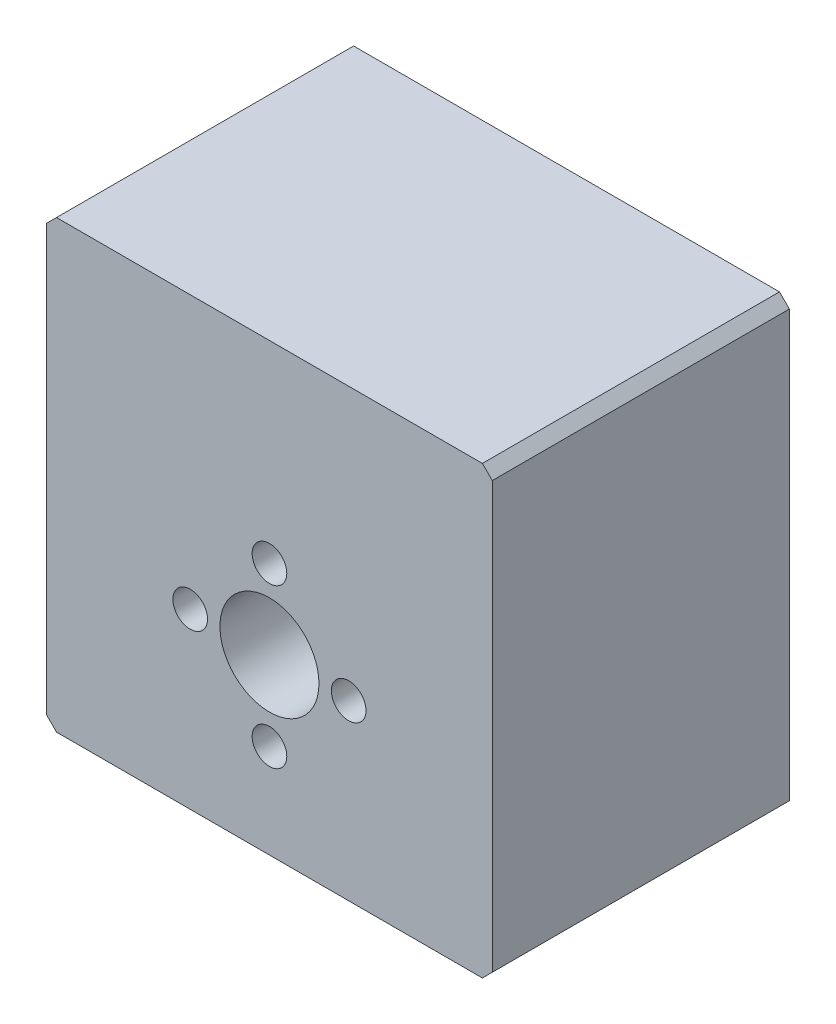
ISO-10303-21;
HEADER;
FILE_DESCRIPTION(('STEP AP214'),'2;1');
FILE_NAME('part.step','',(''),(''),'','','');
FILE_SCHEMA(('AUTOMOTIVE_DESIGN { 1 0 10303 214 1 1 1 1 }'));
ENDSEC;
DATA;
#1=APPLICATION_CONTEXT('core data for automotive mechanical design processes');
#2=APPLICATION_PROTOCOL_DEFINITION('international standard','automotive_design',2000,#1);
#3=PRODUCT_CONTEXT('',#1,'mechanical');
#4=PRODUCT('Part','Part','',(#3));
#5=PRODUCT_RELATED_PRODUCT_CATEGORY('part','',(#4));
#6=PRODUCT_DEFINITION_FORMATION('','',#4);
#7=PRODUCT_DEFINITION_CONTEXT('part definition',#1,'design');
#8=PRODUCT_DEFINITION('design','',#6,#7);
#9=PRODUCT_DEFINITION_SHAPE('','',#8);
#10=(LENGTH_UNIT() NAMED_UNIT(*) SI_UNIT(.MILLI.,.METRE.));
#11=(NAMED_UNIT(*) PLANE_ANGLE_UNIT() SI_UNIT($,.RADIAN.));
#12=(NAMED_UNIT(*) SI_UNIT($,.STERADIAN.) SOLID_ANGLE_UNIT());
#13=UNCERTAINTY_MEASURE_WITH_UNIT(LENGTH_MEASURE(1.E-05),#10,'distance_accuracy_value','');
#14=(GEOMETRIC_REPRESENTATION_CONTEXT(3) GLOBAL_UNCERTAINTY_ASSIGNED_CONTEXT((#13)) GLOBAL_UNIT_ASSIGNED_CONTEXT((#10,
#11,#12)) REPRESENTATION_CONTEXT('',''));
#15=CARTESIAN_POINT('',(0.,0.,0.));
#16=DIRECTION('',(0.,0.,1.));
#17=DIRECTION('',(1.,0.,0.));
#18=AXIS2_PLACEMENT_3D('',#15,#16,#17);
#19=CARTESIAN_POINT('',(0.,0.,15.));
#20=DIRECTION('',(0.,0.,-1.));
#21=DIRECTION('',(-1.,0.,0.));
#22=AXIS2_PLACEMENT_3D('',#19,#20,#21);
#23=PLANE('',#22);
#24=CARTESIAN_POINT('',(0.,8.00000000000001,15.));
#25=DIRECTION('',(0.,0.,1.));
#26=DIRECTION('',(1.,0.,0.));
#27=AXIS2_PLACEMENT_3D('',#24,#25,#26);
#28=CIRCLE('',#27,1.75000000000036);
#29=CARTESIAN_POINT('',(1.75000000000036,8.00000000000001,15.));
#30=VERTEX_POINT('',#29);
#31=EDGE_CURVE('E208',#30,#30,#28,.T.);
#32=ORIENTED_EDGE('',*,*,#31,.F.);
#33=EDGE_LOOP('',(#32));
#34=FACE_BOUND('',#33,.T.);
#35=CARTESIAN_POINT('',(0.,-8.00000000000001,15.));
#36=DIRECTION('',(0.,0.,1.));
#37=DIRECTION('',(1.,0.,0.));
#38=AXIS2_PLACEMENT_3D('',#35,#36,#37);
#39=CIRCLE('',#38,1.75000000000036);
#40=CARTESIAN_POINT('',(1.75000000000036,-8.00000000000001,15.));
#41=VERTEX_POINT('',#40);
#42=EDGE_CURVE('E202',#41,#41,#39,.T.);
#43=ORIENTED_EDGE('',*,*,#42,.F.);
#44=EDGE_LOOP('',(#43));
#45=FACE_BOUND('',#44,.T.);
#46=CARTESIAN_POINT('',(8.00000000000001,0.,15.));
#47=DIRECTION('',(0.,0.,1.));
#48=DIRECTION('',(1.,0.,0.));
#49=AXIS2_PLACEMENT_3D('',#46,#47,#48);
#50=CIRCLE('',#49,1.75000000000036);
#51=CARTESIAN_POINT('',(9.75000000000037,0.,15.));
#52=VERTEX_POINT('',#51);
#53=EDGE_CURVE('E196',#52,#52,#50,.T.);
#54=ORIENTED_EDGE('',*,*,#53,.F.);
#55=EDGE_LOOP('',(#54));
#56=FACE_BOUND('',#55,.T.);
#57=CARTESIAN_POINT('',(-8.00000000000001,0.,15.));
#58=DIRECTION('',(0.,0.,1.));
#59=DIRECTION('',(1.,0.,0.));
#60=AXIS2_PLACEMENT_3D('',#57,#58,#59);
#61=CIRCLE('',#60,1.75000000000036);
#62=CARTESIAN_POINT('',(-6.24999999999964,0.,15.));
#63=VERTEX_POINT('',#62);
#64=EDGE_CURVE('E189',#63,#63,#61,.T.);
#65=ORIENTED_EDGE('',*,*,#64,.F.);
#66=EDGE_LOOP('',(#65));
#67=FACE_BOUND('',#66,.T.);
#68=DIRECTION('',(0.,-1.,0.));
#69=VECTOR('',#68,1.);
#70=CARTESIAN_POINT('',(-22.5,-17.5000000000001,15.));
#71=LINE('',#70,#69);
#72=CARTESIAN_POINT('',(-22.5,26.4999999999999,15.));
#73=VERTEX_POINT('',#72);
#74=CARTESIAN_POINT('',(-22.5,-16.5000000000001,15.));
#75=VERTEX_POINT('',#74);
#76=EDGE_CURVE('E140',#73,#75,#71,.T.);
#77=ORIENTED_EDGE('',*,*,#76,.T.);
#78=DIRECTION('',(-0.707106781186548,0.707106781186548,0.));
#79=VECTOR('',#78,1.);
#80=CARTESIAN_POINT('',(-21.5,-17.5000000000001,15.));
#81=LINE('',#80,#79);
#82=CARTESIAN_POINT('',(-21.5,-17.5000000000001,15.));
#83=VERTEX_POINT('',#82);
#84=EDGE_CURVE('E154',#75,#83,#81,.F.);
#85=ORIENTED_EDGE('',*,*,#84,.T.);
#86=DIRECTION('',(1.,0.,0.));
#87=VECTOR('',#86,1.);
#88=CARTESIAN_POINT('',(22.5,-17.5000000000001,15.));
#89=LINE('',#88,#87);
#90=CARTESIAN_POINT('',(21.5,-17.5000000000001,15.));
#91=VERTEX_POINT('',#90);
#92=EDGE_CURVE('E121',#83,#91,#89,.T.);
#93=ORIENTED_EDGE('',*,*,#92,.T.);
#94=DIRECTION('',(-0.707106781186548,-0.707106781186548,0.));
#95=VECTOR('',#94,1.);
#96=CARTESIAN_POINT('',(22.5,-16.5000000000001,15.));
#97=LINE('',#96,#95);
#98=CARTESIAN_POINT('',(22.5,-16.5000000000001,15.));
#99=VERTEX_POINT('',#98);
#100=EDGE_CURVE('E150',#91,#99,#97,.F.);
#101=ORIENTED_EDGE('',*,*,#100,.T.);
#102=DIRECTION('',(0.,1.,0.));
#103=VECTOR('',#102,1.);
#104=CARTESIAN_POINT('',(22.5,27.4999999999999,15.));
#105=LINE('',#104,#103);
#106=CARTESIAN_POINT('',(22.5,26.4999999999999,15.));
#107=VERTEX_POINT('',#106);
#108=EDGE_CURVE('E163',#99,#107,#105,.T.);
#109=ORIENTED_EDGE('',*,*,#108,.T.);
#110=DIRECTION('',(0.707106781186548,-0.707106781186548,0.));
#111=VECTOR('',#110,1.);
#112=CARTESIAN_POINT('',(21.5,27.4999999999999,15.));
#113=LINE('',#112,#111);
#114=CARTESIAN_POINT('',(21.5,27.4999999999999,15.));
#115=VERTEX_POINT('',#114);
#116=EDGE_CURVE('E56',#107,#115,#113,.F.);
#117=ORIENTED_EDGE('',*,*,#116,.T.);
#118=DIRECTION('',(-1.,0.,0.));
#119=VECTOR('',#118,1.);
#120=CARTESIAN_POINT('',(-22.5,27.4999999999999,15.));
#121=LINE('',#120,#119);
#122=CARTESIAN_POINT('',(-21.5,27.4999999999999,15.));
#123=VERTEX_POINT('',#122);
#124=EDGE_CURVE('E141',#115,#123,#121,.T.);
#125=ORIENTED_EDGE('',*,*,#124,.T.);
#126=DIRECTION('',(0.707106781186548,0.707106781186548,0.));
#127=VECTOR('',#126,1.);
#128=CARTESIAN_POINT('',(-22.5,26.4999999999999,15.));
#129=LINE('',#128,#127);
#130=EDGE_CURVE('E152',#123,#73,#129,.F.);
#131=ORIENTED_EDGE('',*,*,#130,.T.);
#132=EDGE_LOOP('',(#77,#85,#93,#101,#109,#117,#125,#131));
#133=FACE_BOUND('',#132,.T.);
#134=CARTESIAN_POINT('',(0.,0.,15.));
#135=DIRECTION('',(0.,0.,1.));
#136=DIRECTION('',(1.,0.,0.));
#137=AXIS2_PLACEMENT_3D('',#134,#135,#136);
#138=CIRCLE('',#137,4.99999999999989);
#139=CARTESIAN_POINT('',(4.99999999999989,0.,15.));
#140=VERTEX_POINT('',#139);
#141=EDGE_CURVE('E135',#140,#140,#138,.T.);
#142=ORIENTED_EDGE('',*,*,#141,.F.);
#143=EDGE_LOOP('',(#142));
#144=FACE_BOUND('',#143,.T.);
#145=ADVANCED_FACE('F34',(#34,#45,#56,#67,#133,#144),#23,.F.);
#146=CARTESIAN_POINT('',(0.,0.,-15.));
#147=DIRECTION('',(0.,0.,-1.));
#148=DIRECTION('',(-1.,0.,0.));
#149=AXIS2_PLACEMENT_3D('',#146,#147,#148);
#150=PLANE('',#149);
#151=DIRECTION('',(1.,0.,0.));
#152=VECTOR('',#151,1.);
#153=CARTESIAN_POINT('',(22.5,-17.5000000000001,-15.));
#154=LINE('',#153,#152);
#155=CARTESIAN_POINT('',(-21.5,-17.5000000000001,-15.));
#156=VERTEX_POINT('',#155);
#157=CARTESIAN_POINT('',(21.5,-17.5000000000001,-15.));
#158=VERTEX_POINT('',#157);
#159=EDGE_CURVE('E118',#156,#158,#154,.T.);
#160=ORIENTED_EDGE('',*,*,#159,.F.);
#161=DIRECTION('',(0.707106781186548,-0.707106781186548,0.));
#162=VECTOR('',#161,1.);
#163=CARTESIAN_POINT('',(-19.5,-19.5,-15.));
#164=LINE('',#163,#162);
#165=CARTESIAN_POINT('',(-22.5,-16.5000000000001,-15.));
#166=VERTEX_POINT('',#165);
#167=EDGE_CURVE('E101',#156,#166,#164,.F.);
#168=ORIENTED_EDGE('',*,*,#167,.T.);
#169=DIRECTION('',(0.,-1.,0.));
#170=VECTOR('',#169,1.);
#171=CARTESIAN_POINT('',(-22.5,-17.5000000000001,-15.));
#172=LINE('',#171,#170);
#173=CARTESIAN_POINT('',(-22.5,26.4999999999999,-15.));
#174=VERTEX_POINT('',#173);
#175=EDGE_CURVE('E130',#174,#166,#172,.T.);
#176=ORIENTED_EDGE('',*,*,#175,.F.);
#177=DIRECTION('',(-0.707106781186548,-0.707106781186548,0.));
#178=VECTOR('',#177,1.);
#179=CARTESIAN_POINT('',(-24.4999999999999,24.4999999999999,-15.));
#180=LINE('',#179,#178);
#181=CARTESIAN_POINT('',(-21.5,27.4999999999999,-15.));
#182=VERTEX_POINT('',#181);
#183=EDGE_CURVE('E112',#174,#182,#180,.F.);
#184=ORIENTED_EDGE('',*,*,#183,.T.);
#185=DIRECTION('',(-1.,0.,0.));
#186=VECTOR('',#185,1.);
#187=CARTESIAN_POINT('',(-22.5,27.4999999999999,-15.));
#188=LINE('',#187,#186);
#189=CARTESIAN_POINT('',(21.5,27.4999999999999,-15.));
#190=VERTEX_POINT('',#189);
#191=EDGE_CURVE('E133',#190,#182,#188,.T.);
#192=ORIENTED_EDGE('',*,*,#191,.F.);
#193=DIRECTION('',(-0.707106781186548,0.707106781186548,0.));
#194=VECTOR('',#193,1.);
#195=CARTESIAN_POINT('',(24.4999999999999,24.4999999999999,-15.));
#196=LINE('',#195,#194);
#197=CARTESIAN_POINT('',(22.5,26.4999999999999,-15.));
#198=VERTEX_POINT('',#197);
#199=EDGE_CURVE('E122',#190,#198,#196,.F.);
#200=ORIENTED_EDGE('',*,*,#199,.T.);
#201=DIRECTION('',(0.,1.,0.));
#202=VECTOR('',#201,1.);
#203=CARTESIAN_POINT('',(22.5,27.4999999999999,-15.));
#204=LINE('',#203,#202);
#205=CARTESIAN_POINT('',(22.5,-16.5000000000001,-15.));
#206=VERTEX_POINT('',#205);
#207=EDGE_CURVE('E129',#206,#198,#204,.T.);
#208=ORIENTED_EDGE('',*,*,#207,.F.);
#209=DIRECTION('',(0.707106781186548,0.707106781186548,0.));
#210=VECTOR('',#209,1.);
#211=CARTESIAN_POINT('',(19.5,-19.5,-15.));
#212=LINE('',#211,#210);
#213=EDGE_CURVE('E128',#206,#158,#212,.F.);
#214=ORIENTED_EDGE('',*,*,#213,.T.);
#215=EDGE_LOOP('',(#160,#168,#176,#184,#192,#200,#208,#214));
#216=FACE_BOUND('',#215,.T.);
#217=CARTESIAN_POINT('',(0.,0.,-15.));
#218=DIRECTION('',(0.,0.,1.));
#219=DIRECTION('',(1.,0.,0.));
#220=AXIS2_PLACEMENT_3D('',#217,#218,#219);
#221=CIRCLE('',#220,4.99999999999989);
#222=CARTESIAN_POINT('',(4.99999999999989,0.,-15.));
#223=VERTEX_POINT('',#222);
#224=EDGE_CURVE('E183',#223,#223,#221,.T.);
#225=ORIENTED_EDGE('',*,*,#224,.T.);
#226=EDGE_LOOP('',(#225));
#227=FACE_BOUND('',#226,.T.);
#228=ADVANCED_FACE('F125',(#216,#227),#150,.T.);
#229=CARTESIAN_POINT('',(-22.5,-17.5000000000001,15.));
#230=DIRECTION('',(1.,0.,0.));
#231=DIRECTION('',(0.,0.,-1.));
#232=AXIS2_PLACEMENT_3D('',#229,#230,#231);
#233=PLANE('',#232);
#234=ORIENTED_EDGE('',*,*,#175,.T.);
#235=DIRECTION('',(0.,0.,1.));
#236=VECTOR('',#235,1.);
#237=CARTESIAN_POINT('',(-22.5,-16.5000000000001,15.));
#238=LINE('',#237,#236);
#239=EDGE_CURVE('E106',#166,#75,#238,.T.);
#240=ORIENTED_EDGE('',*,*,#239,.T.);
#241=ORIENTED_EDGE('',*,*,#76,.F.);
#242=DIRECTION('',(0.,0.,-1.));
#243=VECTOR('',#242,1.);
#244=CARTESIAN_POINT('',(-22.5,26.4999999999999,15.));
#245=LINE('',#244,#243);
#246=EDGE_CURVE('E111',#73,#174,#245,.T.);
#247=ORIENTED_EDGE('',*,*,#246,.T.);
#248=EDGE_LOOP('',(#234,#240,#241,#247));
#249=FACE_BOUND('',#248,.T.);
#250=ADVANCED_FACE('F179',(#249),#233,.F.);
#251=CARTESIAN_POINT('',(22.5,-17.5000000000001,15.));
#252=DIRECTION('',(0.,1.,0.));
#253=DIRECTION('',(0.,0.,1.));
#254=AXIS2_PLACEMENT_3D('',#251,#252,#253);
#255=PLANE('',#254);
#256=CARTESIAN_POINT('',(-15.,-17.5000000000001,8.));
#257=DIRECTION('',(0.,1.,0.));
#258=DIRECTION('',(0.,0.,-1.));
#259=AXIS2_PLACEMENT_3D('',#256,#257,#258);
#260=CIRCLE('',#259,2.);
#261=CARTESIAN_POINT('',(-15.,-17.5000000000001,6.));
#262=VERTEX_POINT('',#261);
#263=EDGE_CURVE('E231',#262,#262,#260,.T.);
#264=ORIENTED_EDGE('',*,*,#263,.T.);
#265=EDGE_LOOP('',(#264));
#266=FACE_BOUND('',#265,.T.);
#267=CARTESIAN_POINT('',(-15.,-17.5000000000001,-8.));
#268=DIRECTION('',(0.,1.,0.));
#269=DIRECTION('',(0.,0.,-1.));
#270=AXIS2_PLACEMENT_3D('',#267,#268,#269);
#271=CIRCLE('',#270,2.);
#272=CARTESIAN_POINT('',(-15.,-17.5000000000001,-10.));
#273=VERTEX_POINT('',#272);
#274=EDGE_CURVE('E225',#273,#273,#271,.T.);
#275=ORIENTED_EDGE('',*,*,#274,.T.);
#276=EDGE_LOOP('',(#275));
#277=FACE_BOUND('',#276,.T.);
#278=CARTESIAN_POINT('',(15.,-17.5000000000001,8.));
#279=DIRECTION('',(0.,-1.,0.));
#280=DIRECTION('',(0.,0.,-1.));
#281=AXIS2_PLACEMENT_3D('',#278,#279,#280);
#282=CIRCLE('',#281,2.);
#283=CARTESIAN_POINT('',(15.,-17.5000000000001,6.));
#284=VERTEX_POINT('',#283);
#285=EDGE_CURVE('E220',#284,#284,#282,.T.);
#286=ORIENTED_EDGE('',*,*,#285,.F.);
#287=EDGE_LOOP('',(#286));
#288=FACE_BOUND('',#287,.T.);
#289=CARTESIAN_POINT('',(15.,-17.5000000000001,-8.));
#290=DIRECTION('',(0.,-1.,0.));
#291=DIRECTION('',(0.,0.,-1.));
#292=AXIS2_PLACEMENT_3D('',#289,#290,#291);
#293=CIRCLE('',#292,2.);
#294=CARTESIAN_POINT('',(15.,-17.5000000000001,-10.));
#295=VERTEX_POINT('',#294);
#296=EDGE_CURVE('E213',#295,#295,#293,.T.);
#297=ORIENTED_EDGE('',*,*,#296,.F.);
#298=EDGE_LOOP('',(#297));
#299=FACE_BOUND('',#298,.T.);
#300=ORIENTED_EDGE('',*,*,#92,.F.);
#301=DIRECTION('',(0.,0.,-1.));
#302=VECTOR('',#301,1.);
#303=CARTESIAN_POINT('',(-21.5,-17.5000000000001,15.));
#304=LINE('',#303,#302);
#305=EDGE_CURVE('E105',#83,#156,#304,.T.);
#306=ORIENTED_EDGE('',*,*,#305,.T.);
#307=ORIENTED_EDGE('',*,*,#159,.T.);
#308=DIRECTION('',(0.,0.,1.));
#309=VECTOR('',#308,1.);
#310=CARTESIAN_POINT('',(21.5,-17.5000000000001,15.));
#311=LINE('',#310,#309);
#312=EDGE_CURVE('E123',#158,#91,#311,.T.);
#313=ORIENTED_EDGE('',*,*,#312,.T.);
#314=EDGE_LOOP('',(#300,#306,#307,#313));
#315=FACE_BOUND('',#314,.T.);
#316=ADVANCED_FACE('F117',(#266,#277,#288,#299,#315),#255,.F.);
#317=CARTESIAN_POINT('',(22.5,27.4999999999999,15.));
#318=DIRECTION('',(-1.,0.,0.));
#319=DIRECTION('',(0.,0.,1.));
#320=AXIS2_PLACEMENT_3D('',#317,#318,#319);
#321=PLANE('',#320);
#322=ORIENTED_EDGE('',*,*,#108,.F.);
#323=DIRECTION('',(0.,0.,-1.));
#324=VECTOR('',#323,1.);
#325=CARTESIAN_POINT('',(22.5,-16.5000000000001,15.));
#326=LINE('',#325,#324);
#327=EDGE_CURVE('E11',#99,#206,#326,.T.);
#328=ORIENTED_EDGE('',*,*,#327,.T.);
#329=ORIENTED_EDGE('',*,*,#207,.T.);
#330=DIRECTION('',(0.,0.,1.));
#331=VECTOR('',#330,1.);
#332=CARTESIAN_POINT('',(22.5,26.4999999999999,15.));
#333=LINE('',#332,#331);
#334=EDGE_CURVE('E42',#198,#107,#333,.T.);
#335=ORIENTED_EDGE('',*,*,#334,.T.);
#336=EDGE_LOOP('',(#322,#328,#329,#335));
#337=FACE_BOUND('',#336,.T.);
#338=ADVANCED_FACE('F162',(#337),#321,.F.);
#339=CARTESIAN_POINT('',(-22.5,27.4999999999999,15.));
#340=DIRECTION('',(0.,-1.,0.));
#341=DIRECTION('',(0.,0.,-1.));
#342=AXIS2_PLACEMENT_3D('',#339,#340,#341);
#343=PLANE('',#342);
#344=ORIENTED_EDGE('',*,*,#191,.T.);
#345=DIRECTION('',(0.,0.,1.));
#346=VECTOR('',#345,1.);
#347=CARTESIAN_POINT('',(-21.5,27.4999999999999,15.));
#348=LINE('',#347,#346);
#349=EDGE_CURVE('E49',#182,#123,#348,.T.);
#350=ORIENTED_EDGE('',*,*,#349,.T.);
#351=ORIENTED_EDGE('',*,*,#124,.F.);
#352=DIRECTION('',(0.,0.,-1.));
#353=VECTOR('',#352,1.);
#354=CARTESIAN_POINT('',(21.5,27.4999999999999,15.));
#355=LINE('',#354,#353);
#356=EDGE_CURVE('E156',#115,#190,#355,.T.);
#357=ORIENTED_EDGE('',*,*,#356,.T.);
#358=EDGE_LOOP('',(#344,#350,#351,#357));
#359=FACE_BOUND('',#358,.T.);
#360=ADVANCED_FACE('F172',(#359),#343,.F.);
#361=CARTESIAN_POINT('',(0.,0.,15.));
#362=DIRECTION('',(0.,0.,-1.));
#363=DIRECTION('',(-1.,0.,0.));
#364=AXIS2_PLACEMENT_3D('',#361,#362,#363);
#365=CYLINDRICAL_SURFACE('',#364,4.99999999999989);
#366=ORIENTED_EDGE('',*,*,#141,.T.);
#367=EDGE_LOOP('',(#366));
#368=FACE_BOUND('',#367,.T.);
#369=ORIENTED_EDGE('',*,*,#224,.F.);
#370=EDGE_LOOP('',(#369));
#371=FACE_BOUND('',#370,.T.);
#372=ADVANCED_FACE('F258',(#368,#371),#365,.F.);
#373=CARTESIAN_POINT('',(-8.00000000000001,0.,5.));
#374=DIRECTION('',(0.,0.,1.));
#375=DIRECTION('',(1.,0.,0.));
#376=AXIS2_PLACEMENT_3D('',#373,#374,#375);
#377=CYLINDRICAL_SURFACE('',#376,1.75000000000036);
#378=CARTESIAN_POINT('',(-8.00000000000001,0.,5.));
#379=DIRECTION('',(0.,0.,1.));
#380=DIRECTION('',(1.,0.,0.));
#381=AXIS2_PLACEMENT_3D('',#378,#379,#380);
#382=CIRCLE('',#381,1.75000000000036);
#383=CARTESIAN_POINT('',(-6.24999999999964,0.,5.));
#384=VERTEX_POINT('',#383);
#385=EDGE_CURVE('E192',#384,#384,#382,.T.);
#386=ORIENTED_EDGE('',*,*,#385,.F.);
#387=EDGE_LOOP('',(#386));
#388=FACE_BOUND('',#387,.T.);
#389=ORIENTED_EDGE('',*,*,#64,.T.);
#390=EDGE_LOOP('',(#389));
#391=FACE_BOUND('',#390,.T.);
#392=ADVANCED_FACE('F322',(#388,#391),#377,.F.);
#393=CARTESIAN_POINT('',(-8.00000000000001,0.,5.));
#394=DIRECTION('',(0.,0.,1.));
#395=DIRECTION('',(1.,0.,0.));
#396=AXIS2_PLACEMENT_3D('',#393,#394,#395);
#397=PLANE('',#396);
#398=ORIENTED_EDGE('',*,*,#385,.T.);
#399=EDGE_LOOP('',(#398));
#400=FACE_BOUND('',#399,.T.);
#401=ADVANCED_FACE('F319',(#400),#397,.T.);
#402=CARTESIAN_POINT('',(8.00000000000001,0.,5.));
#403=DIRECTION('',(0.,0.,1.));
#404=DIRECTION('',(1.,0.,0.));
#405=AXIS2_PLACEMENT_3D('',#402,#403,#404);
#406=CYLINDRICAL_SURFACE('',#405,1.75000000000036);
#407=CARTESIAN_POINT('',(8.00000000000001,0.,5.));
#408=DIRECTION('',(0.,0.,1.));
#409=DIRECTION('',(1.,0.,0.));
#410=AXIS2_PLACEMENT_3D('',#407,#408,#409);
#411=CIRCLE('',#410,1.75000000000036);
#412=CARTESIAN_POINT('',(9.75000000000037,0.,5.));
#413=VERTEX_POINT('',#412);
#414=EDGE_CURVE('E199',#413,#413,#411,.T.);
#415=ORIENTED_EDGE('',*,*,#414,.F.);
#416=EDGE_LOOP('',(#415));
#417=FACE_BOUND('',#416,.T.);
#418=ORIENTED_EDGE('',*,*,#53,.T.);
#419=EDGE_LOOP('',(#418));
#420=FACE_BOUND('',#419,.T.);
#421=ADVANCED_FACE('F315',(#417,#420),#406,.F.);
#422=CARTESIAN_POINT('',(8.00000000000001,0.,5.));
#423=DIRECTION('',(0.,0.,1.));
#424=DIRECTION('',(1.,0.,0.));
#425=AXIS2_PLACEMENT_3D('',#422,#423,#424);
#426=PLANE('',#425);
#427=ORIENTED_EDGE('',*,*,#414,.T.);
#428=EDGE_LOOP('',(#427));
#429=FACE_BOUND('',#428,.T.);
#430=ADVANCED_FACE('F311',(#429),#426,.T.);
#431=CARTESIAN_POINT('',(0.,-8.00000000000001,5.));
#432=DIRECTION('',(0.,0.,1.));
#433=DIRECTION('',(1.,0.,0.));
#434=AXIS2_PLACEMENT_3D('',#431,#432,#433);
#435=CYLINDRICAL_SURFACE('',#434,1.75000000000036);
#436=CARTESIAN_POINT('',(0.,-8.00000000000001,5.));
#437=DIRECTION('',(0.,0.,1.));
#438=DIRECTION('',(1.,0.,0.));
#439=AXIS2_PLACEMENT_3D('',#436,#437,#438);
#440=CIRCLE('',#439,1.75000000000036);
#441=CARTESIAN_POINT('',(1.75000000000036,-8.00000000000001,5.));
#442=VERTEX_POINT('',#441);
#443=EDGE_CURVE('E205',#442,#442,#440,.T.);
#444=ORIENTED_EDGE('',*,*,#443,.F.);
#445=EDGE_LOOP('',(#444));
#446=FACE_BOUND('',#445,.T.);
#447=ORIENTED_EDGE('',*,*,#42,.T.);
#448=EDGE_LOOP('',(#447));
#449=FACE_BOUND('',#448,.T.);
#450=ADVANCED_FACE('F307',(#446,#449),#435,.F.);
#451=CARTESIAN_POINT('',(0.,-8.00000000000001,5.));
#452=DIRECTION('',(0.,0.,1.));
#453=DIRECTION('',(1.,0.,0.));
#454=AXIS2_PLACEMENT_3D('',#451,#452,#453);
#455=PLANE('',#454);
#456=ORIENTED_EDGE('',*,*,#443,.T.);
#457=EDGE_LOOP('',(#456));
#458=FACE_BOUND('',#457,.T.);
#459=ADVANCED_FACE('F303',(#458),#455,.T.);
#460=CARTESIAN_POINT('',(0.,8.00000000000001,5.));
#461=DIRECTION('',(0.,0.,1.));
#462=DIRECTION('',(1.,0.,0.));
#463=AXIS2_PLACEMENT_3D('',#460,#461,#462);
#464=CYLINDRICAL_SURFACE('',#463,1.75000000000036);
#465=CARTESIAN_POINT('',(0.,8.00000000000001,5.));
#466=DIRECTION('',(0.,0.,1.));
#467=DIRECTION('',(1.,0.,0.));
#468=AXIS2_PLACEMENT_3D('',#465,#466,#467);
#469=CIRCLE('',#468,1.75000000000036);
#470=CARTESIAN_POINT('',(1.75000000000036,8.00000000000001,5.));
#471=VERTEX_POINT('',#470);
#472=EDGE_CURVE('E186',#471,#471,#469,.T.);
#473=ORIENTED_EDGE('',*,*,#472,.F.);
#474=EDGE_LOOP('',(#473));
#475=FACE_BOUND('',#474,.T.);
#476=ORIENTED_EDGE('',*,*,#31,.T.);
#477=EDGE_LOOP('',(#476));
#478=FACE_BOUND('',#477,.T.);
#479=ADVANCED_FACE('F299',(#475,#478),#464,.F.);
#480=CARTESIAN_POINT('',(0.,8.00000000000001,5.));
#481=DIRECTION('',(0.,0.,1.));
#482=DIRECTION('',(1.,0.,0.));
#483=AXIS2_PLACEMENT_3D('',#480,#481,#482);
#484=PLANE('',#483);
#485=ORIENTED_EDGE('',*,*,#472,.T.);
#486=EDGE_LOOP('',(#485));
#487=FACE_BOUND('',#486,.T.);
#488=ADVANCED_FACE('F272',(#487),#484,.T.);
#489=CARTESIAN_POINT('',(-21.5,-17.5000000000001,15.));
#490=DIRECTION('',(0.707106781186547,0.707106781186547,0.));
#491=DIRECTION('',(0.,0.,-1.));
#492=AXIS2_PLACEMENT_3D('',#489,#490,#491);
#493=PLANE('',#492);
#494=ORIENTED_EDGE('',*,*,#84,.F.);
#495=ORIENTED_EDGE('',*,*,#239,.F.);
#496=ORIENTED_EDGE('',*,*,#167,.F.);
#497=ORIENTED_EDGE('',*,*,#305,.F.);
#498=EDGE_LOOP('',(#494,#495,#496,#497));
#499=FACE_BOUND('',#498,.T.);
#500=ADVANCED_FACE('F104',(#499),#493,.F.);
#501=CARTESIAN_POINT('',(-22.5,26.4999999999999,15.));
#502=DIRECTION('',(0.707106781186547,-0.707106781186547,0.));
#503=DIRECTION('',(0.,0.,-1.));
#504=AXIS2_PLACEMENT_3D('',#501,#502,#503);
#505=PLANE('',#504);
#506=ORIENTED_EDGE('',*,*,#130,.F.);
#507=ORIENTED_EDGE('',*,*,#349,.F.);
#508=ORIENTED_EDGE('',*,*,#183,.F.);
#509=ORIENTED_EDGE('',*,*,#246,.F.);
#510=EDGE_LOOP('',(#506,#507,#508,#509));
#511=FACE_BOUND('',#510,.T.);
#512=ADVANCED_FACE('F176',(#511),#505,.F.);
#513=CARTESIAN_POINT('',(22.5,-16.5000000000001,15.));
#514=DIRECTION('',(-0.707106781186547,0.707106781186547,0.));
#515=DIRECTION('',(0.,0.,-1.));
#516=AXIS2_PLACEMENT_3D('',#513,#514,#515);
#517=PLANE('',#516);
#518=ORIENTED_EDGE('',*,*,#100,.F.);
#519=ORIENTED_EDGE('',*,*,#312,.F.);
#520=ORIENTED_EDGE('',*,*,#213,.F.);
#521=ORIENTED_EDGE('',*,*,#327,.F.);
#522=EDGE_LOOP('',(#518,#519,#520,#521));
#523=FACE_BOUND('',#522,.T.);
#524=ADVANCED_FACE('F274',(#523),#517,.F.);
#525=CARTESIAN_POINT('',(21.5,27.4999999999999,15.));
#526=DIRECTION('',(-0.707106781186547,-0.707106781186547,0.));
#527=DIRECTION('',(0.,0.,-1.));
#528=AXIS2_PLACEMENT_3D('',#525,#526,#527);
#529=PLANE('',#528);
#530=ORIENTED_EDGE('',*,*,#116,.F.);
#531=ORIENTED_EDGE('',*,*,#334,.F.);
#532=ORIENTED_EDGE('',*,*,#199,.F.);
#533=ORIENTED_EDGE('',*,*,#356,.F.);
#534=EDGE_LOOP('',(#530,#531,#532,#533));
#535=FACE_BOUND('',#534,.T.);
#536=ADVANCED_FACE('F36',(#535),#529,.F.);
#537=CARTESIAN_POINT('',(15.,-7.50000000000007,-8.));
#538=DIRECTION('',(0.,-1.,0.));
#539=DIRECTION('',(0.,0.,-1.));
#540=AXIS2_PLACEMENT_3D('',#537,#538,#539);
#541=CYLINDRICAL_SURFACE('',#540,2.);
#542=CARTESIAN_POINT('',(15.,-7.50000000000007,-8.));
#543=DIRECTION('',(0.,-1.,0.));
#544=DIRECTION('',(0.,0.,-1.));
#545=AXIS2_PLACEMENT_3D('',#542,#543,#544);
#546=CIRCLE('',#545,2.);
#547=CARTESIAN_POINT('',(15.,-7.50000000000007,-10.));
#548=VERTEX_POINT('',#547);
#549=EDGE_CURVE('E216',#548,#548,#546,.T.);
#550=ORIENTED_EDGE('',*,*,#549,.F.);
#551=EDGE_LOOP('',(#550));
#552=FACE_BOUND('',#551,.T.);
#553=ORIENTED_EDGE('',*,*,#296,.T.);
#554=EDGE_LOOP('',(#553));
#555=FACE_BOUND('',#554,.T.);
#556=ADVANCED_FACE('F280',(#552,#555),#541,.F.);
#557=CARTESIAN_POINT('',(15.,-7.50000000000007,-8.));
#558=DIRECTION('',(0.,-1.,0.));
#559=DIRECTION('',(0.,0.,-1.));
#560=AXIS2_PLACEMENT_3D('',#557,#558,#559);
#561=PLANE('',#560);
#562=ORIENTED_EDGE('',*,*,#549,.T.);
#563=EDGE_LOOP('',(#562));
#564=FACE_BOUND('',#563,.T.);
#565=ADVANCED_FACE('F284',(#564),#561,.T.);
#566=CARTESIAN_POINT('',(15.,-7.50000000000007,8.));
#567=DIRECTION('',(0.,-1.,0.));
#568=DIRECTION('',(0.,0.,-1.));
#569=AXIS2_PLACEMENT_3D('',#566,#567,#568);
#570=CYLINDRICAL_SURFACE('',#569,2.);
#571=CARTESIAN_POINT('',(15.,-7.50000000000007,8.));
#572=DIRECTION('',(0.,-1.,0.));
#573=DIRECTION('',(0.,0.,-1.));
#574=AXIS2_PLACEMENT_3D('',#571,#572,#573);
#575=CIRCLE('',#574,2.);
#576=CARTESIAN_POINT('',(15.,-7.50000000000007,6.));
#577=VERTEX_POINT('',#576);
#578=EDGE_CURVE('E193',#577,#577,#575,.T.);
#579=ORIENTED_EDGE('',*,*,#578,.F.);
#580=EDGE_LOOP('',(#579));
#581=FACE_BOUND('',#580,.T.);
#582=ORIENTED_EDGE('',*,*,#285,.T.);
#583=EDGE_LOOP('',(#582));
#584=FACE_BOUND('',#583,.T.);
#585=ADVANCED_FACE('F290',(#581,#584),#570,.F.);
#586=CARTESIAN_POINT('',(15.,-7.50000000000007,8.));
#587=DIRECTION('',(0.,-1.,0.));
#588=DIRECTION('',(0.,0.,-1.));
#589=AXIS2_PLACEMENT_3D('',#586,#587,#588);
#590=PLANE('',#589);
#591=ORIENTED_EDGE('',*,*,#578,.T.);
#592=EDGE_LOOP('',(#591));
#593=FACE_BOUND('',#592,.T.);
#594=ADVANCED_FACE('F459',(#593),#590,.T.);
#595=CARTESIAN_POINT('',(-15.,-7.50000000000007,-8.));
#596=DIRECTION('',(0.,-1.,0.));
#597=DIRECTION('',(0.,0.,-1.));
#598=AXIS2_PLACEMENT_3D('',#595,#596,#597);
#599=CYLINDRICAL_SURFACE('',#598,2.);
#600=CARTESIAN_POINT('',(-15.,-7.50000000000007,-8.));
#601=DIRECTION('',(0.,1.,0.));
#602=DIRECTION('',(0.,0.,-1.));
#603=AXIS2_PLACEMENT_3D('',#600,#601,#602);
#604=CIRCLE('',#603,2.);
#605=CARTESIAN_POINT('',(-15.,-7.50000000000007,-10.));
#606=VERTEX_POINT('',#605);
#607=EDGE_CURVE('E228',#606,#606,#604,.T.);
#608=ORIENTED_EDGE('',*,*,#607,.T.);
#609=EDGE_LOOP('',(#608));
#610=FACE_BOUND('',#609,.T.);
#611=ORIENTED_EDGE('',*,*,#274,.F.);
#612=EDGE_LOOP('',(#611));
#613=FACE_BOUND('',#612,.T.);
#614=ADVANCED_FACE('F467',(#610,#613),#599,.F.);
#615=CARTESIAN_POINT('',(-15.,-7.50000000000007,-8.));
#616=DIRECTION('',(0.,-1.,0.));
#617=DIRECTION('',(0.,0.,-1.));
#618=AXIS2_PLACEMENT_3D('',#615,#616,#617);
#619=PLANE('',#618);
#620=ORIENTED_EDGE('',*,*,#607,.F.);
#621=EDGE_LOOP('',(#620));
#622=FACE_BOUND('',#621,.T.);
#623=ADVANCED_FACE('F246',(#622),#619,.T.);
#624=CARTESIAN_POINT('',(-15.,-7.50000000000007,8.));
#625=DIRECTION('',(0.,-1.,0.));
#626=DIRECTION('',(0.,0.,-1.));
#627=AXIS2_PLACEMENT_3D('',#624,#625,#626);
#628=CYLINDRICAL_SURFACE('',#627,2.);
#629=CARTESIAN_POINT('',(-15.,-7.50000000000007,8.));
#630=DIRECTION('',(0.,1.,0.));
#631=DIRECTION('',(0.,0.,-1.));
#632=AXIS2_PLACEMENT_3D('',#629,#630,#631);
#633=CIRCLE('',#632,2.);
#634=CARTESIAN_POINT('',(-15.,-7.50000000000007,6.));
#635=VERTEX_POINT('',#634);
#636=EDGE_CURVE('E217',#635,#635,#633,.T.);
#637=ORIENTED_EDGE('',*,*,#636,.T.);
#638=EDGE_LOOP('',(#637));
#639=FACE_BOUND('',#638,.T.);
#640=ORIENTED_EDGE('',*,*,#263,.F.);
#641=EDGE_LOOP('',(#640));
#642=FACE_BOUND('',#641,.T.);
#643=ADVANCED_FACE('F237',(#639,#642),#628,.F.);
#644=CARTESIAN_POINT('',(-15.,-7.50000000000007,8.));
#645=DIRECTION('',(0.,-1.,0.));
#646=DIRECTION('',(0.,0.,-1.));
#647=AXIS2_PLACEMENT_3D('',#644,#645,#646);
#648=PLANE('',#647);
#649=ORIENTED_EDGE('',*,*,#636,.F.);
#650=EDGE_LOOP('',(#649));
#651=FACE_BOUND('',#650,.T.);
#652=ADVANCED_FACE('F240',(#651),#648,.T.);
#653=CLOSED_SHELL('',(#145,#228,#250,#316,#338,#360,#372,#392,#401,#421,#430,#450,#459,#479,
#488,#500,#512,#524,#536,#556,#565,#585,#594,#614,#623,#643,#652));
#654=MANIFOLD_SOLID_BREP('B2',#653);
#655=ADVANCED_BREP_SHAPE_REPRESENTATION('',(#18,#654),#14);
#656=SHAPE_DEFINITION_REPRESENTATION(#9,#655);
ENDSEC;
END-ISO-10303-21;
